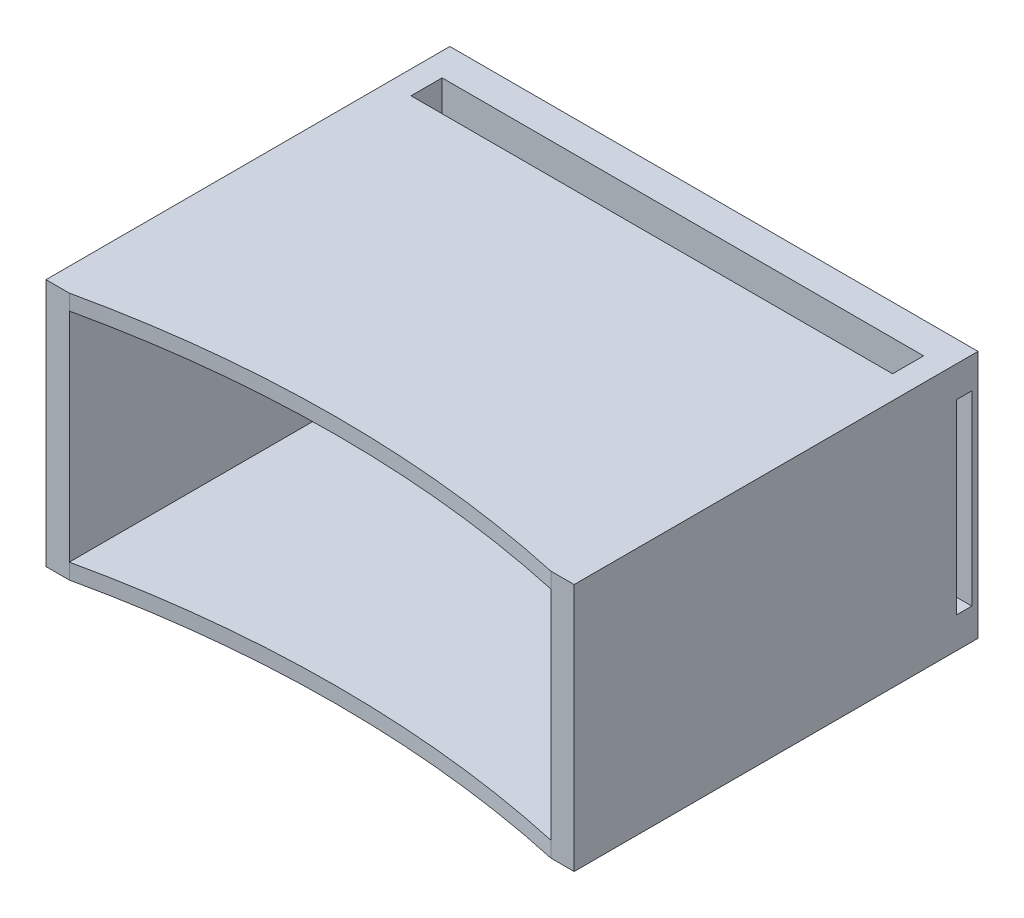
ISO-10303-21;
HEADER;
FILE_DESCRIPTION(('STEP AP214'),'2;1');
FILE_NAME('part.step','',(''),(''),'','','');
FILE_SCHEMA(('AUTOMOTIVE_DESIGN { 1 0 10303 214 1 1 1 1 }'));
ENDSEC;
DATA;
#1=APPLICATION_CONTEXT('core data for automotive mechanical design processes');
#2=APPLICATION_PROTOCOL_DEFINITION('international standard','automotive_design',2000,#1);
#3=PRODUCT_CONTEXT('',#1,'mechanical');
#4=PRODUCT('Part','Part','',(#3));
#5=PRODUCT_RELATED_PRODUCT_CATEGORY('part','',(#4));
#6=PRODUCT_DEFINITION_FORMATION('','',#4);
#7=PRODUCT_DEFINITION_CONTEXT('part definition',#1,'design');
#8=PRODUCT_DEFINITION('design','',#6,#7);
#9=PRODUCT_DEFINITION_SHAPE('','',#8);
#10=(LENGTH_UNIT() NAMED_UNIT(*) SI_UNIT(.MILLI.,.METRE.));
#11=(NAMED_UNIT(*) PLANE_ANGLE_UNIT() SI_UNIT($,.RADIAN.));
#12=(NAMED_UNIT(*) SI_UNIT($,.STERADIAN.) SOLID_ANGLE_UNIT());
#13=UNCERTAINTY_MEASURE_WITH_UNIT(LENGTH_MEASURE(1.E-05),#10,'distance_accuracy_value','');
#14=(GEOMETRIC_REPRESENTATION_CONTEXT(3) GLOBAL_UNCERTAINTY_ASSIGNED_CONTEXT((#13)) GLOBAL_UNIT_ASSIGNED_CONTEXT((#10,
#11,#12)) REPRESENTATION_CONTEXT('',''));
#15=CARTESIAN_POINT('',(0.,0.,0.));
#16=DIRECTION('',(0.,0.,1.));
#17=DIRECTION('',(1.,0.,0.));
#18=AXIS2_PLACEMENT_3D('',#15,#16,#17);
#19=CARTESIAN_POINT('',(0.,0.,85.));
#20=DIRECTION('',(0.,0.,-1.));
#21=DIRECTION('',(-1.,0.,0.));
#22=AXIS2_PLACEMENT_3D('',#19,#20,#21);
#23=PLANE('',#22);
#24=DIRECTION('',(1.,0.,0.));
#25=VECTOR('',#24,1.);
#26=CARTESIAN_POINT('',(-85.,0.,85.));
#27=LINE('',#26,#25);
#28=CARTESIAN_POINT('',(-85.,0.,85.));
#29=VERTEX_POINT('',#28);
#30=CARTESIAN_POINT('',(-77.5,0.,85.));
#31=VERTEX_POINT('',#30);
#32=EDGE_CURVE('E303',#29,#31,#27,.T.);
#33=ORIENTED_EDGE('',*,*,#32,.T.);
#34=DIRECTION('',(0.,1.,0.));
#35=VECTOR('',#34,1.);
#36=CARTESIAN_POINT('',(-77.5,0.,85.));
#37=LINE('',#36,#35);
#38=CARTESIAN_POINT('',(-77.5,5.,85.));
#39=VERTEX_POINT('',#38);
#40=EDGE_CURVE('E273',#31,#39,#37,.T.);
#41=ORIENTED_EDGE('',*,*,#40,.T.);
#42=DIRECTION('',(0.,-1.,0.));
#43=VECTOR('',#42,1.);
#44=CARTESIAN_POINT('',(-77.5,75.,85.));
#45=LINE('',#44,#43);
#46=CARTESIAN_POINT('',(-77.5,75.,85.));
#47=VERTEX_POINT('',#46);
#48=EDGE_CURVE('E290',#47,#39,#45,.T.);
#49=ORIENTED_EDGE('',*,*,#48,.F.);
#50=DIRECTION('',(0.,1.,0.));
#51=VECTOR('',#50,1.);
#52=CARTESIAN_POINT('',(-77.4999999999998,0.,85.));
#53=LINE('',#52,#51);
#54=CARTESIAN_POINT('',(-77.5,80.,85.));
#55=VERTEX_POINT('',#54);
#56=EDGE_CURVE('E11',#47,#55,#53,.T.);
#57=ORIENTED_EDGE('',*,*,#56,.T.);
#58=DIRECTION('',(-1.,0.,0.));
#59=VECTOR('',#58,1.);
#60=CARTESIAN_POINT('',(-85.,80.,85.));
#61=LINE('',#60,#59);
#62=CARTESIAN_POINT('',(-85.,80.,85.));
#63=VERTEX_POINT('',#62);
#64=EDGE_CURVE('E311',#55,#63,#61,.T.);
#65=ORIENTED_EDGE('',*,*,#64,.T.);
#66=DIRECTION('',(0.,-1.,0.));
#67=VECTOR('',#66,1.);
#68=CARTESIAN_POINT('',(-85.,0.,85.));
#69=LINE('',#68,#67);
#70=EDGE_CURVE('E298',#63,#29,#69,.T.);
#71=ORIENTED_EDGE('',*,*,#70,.T.);
#72=EDGE_LOOP('',(#33,#41,#49,#57,#65,#71));
#73=FACE_BOUND('',#72,.T.);
#74=ADVANCED_FACE('F41',(#73),#23,.F.);
#75=CARTESIAN_POINT('',(77.5,5.00000000000002,-35.));
#76=DIRECTION('',(0.,-1.,0.));
#77=DIRECTION('',(1.,0.,0.));
#78=AXIS2_PLACEMENT_3D('',#75,#76,#77);
#79=PLANE('',#78);
#80=DIRECTION('',(-1.,0.,0.));
#81=VECTOR('',#80,1.);
#82=CARTESIAN_POINT('',(0.,5.00000000000002,-23.));
#83=LINE('',#82,#81);
#84=CARTESIAN_POINT('',(76.,5.00000000000002,-23.));
#85=VERTEX_POINT('',#84);
#86=CARTESIAN_POINT('',(-76.,5.,-23.));
#87=VERTEX_POINT('',#86);
#88=EDGE_CURVE('E337',#85,#87,#83,.T.);
#89=ORIENTED_EDGE('',*,*,#88,.F.);
#90=DIRECTION('',(0.,0.,-1.));
#91=VECTOR('',#90,1.);
#92=CARTESIAN_POINT('',(76.,5.00000000000002,-20.));
#93=LINE('',#92,#91);
#94=CARTESIAN_POINT('',(76.,5.00000000000002,-35.));
#95=VERTEX_POINT('',#94);
#96=EDGE_CURVE('E413',#85,#95,#93,.T.);
#97=ORIENTED_EDGE('',*,*,#96,.T.);
#98=DIRECTION('',(1.,0.,0.));
#99=VECTOR('',#98,1.);
#100=CARTESIAN_POINT('',(77.5,5.00000000000002,-35.));
#101=LINE('',#100,#99);
#102=CARTESIAN_POINT('',(-76.,5.,-35.));
#103=VERTEX_POINT('',#102);
#104=EDGE_CURVE('E459',#103,#95,#101,.T.);
#105=ORIENTED_EDGE('',*,*,#104,.F.);
#106=DIRECTION('',(0.,0.,-1.));
#107=VECTOR('',#106,1.);
#108=CARTESIAN_POINT('',(-76.,5.,-20.));
#109=LINE('',#108,#107);
#110=EDGE_CURVE('E360',#87,#103,#109,.T.);
#111=ORIENTED_EDGE('',*,*,#110,.F.);
#112=EDGE_LOOP('',(#89,#97,#105,#111));
#113=FACE_BOUND('',#112,.T.);
#114=ADVANCED_FACE('F552',(#113),#79,.F.);
#115=CARTESIAN_POINT('',(76.,0.,-20.));
#116=DIRECTION('',(-1.,0.,0.));
#117=DIRECTION('',(0.,0.,1.));
#118=AXIS2_PLACEMENT_3D('',#115,#116,#117);
#119=PLANE('',#118);
#120=ORIENTED_EDGE('',*,*,#96,.F.);
#121=DIRECTION('',(0.,-1.,0.));
#122=VECTOR('',#121,1.);
#123=CARTESIAN_POINT('',(76.,10.,-23.));
#124=LINE('',#123,#122);
#125=CARTESIAN_POINT('',(76.,10.,-23.));
#126=VERTEX_POINT('',#125);
#127=EDGE_CURVE('E357',#126,#85,#124,.T.);
#128=ORIENTED_EDGE('',*,*,#127,.F.);
#129=DIRECTION('',(0.,0.,1.));
#130=VECTOR('',#129,1.);
#131=CARTESIAN_POINT('',(76.,10.,0.));
#132=LINE('',#131,#130);
#133=CARTESIAN_POINT('',(76.,10.,-20.));
#134=VERTEX_POINT('',#133);
#135=EDGE_CURVE('E317',#126,#134,#132,.T.);
#136=ORIENTED_EDGE('',*,*,#135,.T.);
#137=DIRECTION('',(0.,1.,0.));
#138=VECTOR('',#137,1.);
#139=CARTESIAN_POINT('',(76.,0.,-20.));
#140=LINE('',#139,#138);
#141=CARTESIAN_POINT('',(76.,40.,-20.));
#142=VERTEX_POINT('',#141);
#143=EDGE_CURVE('E405',#134,#142,#140,.T.);
#144=ORIENTED_EDGE('',*,*,#143,.T.);
#145=DIRECTION('',(0.,0.,-1.));
#146=VECTOR('',#145,1.);
#147=CARTESIAN_POINT('',(76.,40.,-20.));
#148=LINE('',#147,#146);
#149=CARTESIAN_POINT('',(76.,40.,-35.));
#150=VERTEX_POINT('',#149);
#151=EDGE_CURVE('E421',#142,#150,#148,.T.);
#152=ORIENTED_EDGE('',*,*,#151,.T.);
#153=DIRECTION('',(0.,1.,0.));
#154=VECTOR('',#153,1.);
#155=CARTESIAN_POINT('',(76.,0.,-35.));
#156=LINE('',#155,#154);
#157=EDGE_CURVE('E401',#95,#150,#156,.T.);
#158=ORIENTED_EDGE('',*,*,#157,.F.);
#159=EDGE_LOOP('',(#120,#128,#136,#144,#152,#158));
#160=FACE_BOUND('',#159,.T.);
#161=ADVANCED_FACE('F544',(#160),#119,.T.);
#162=CARTESIAN_POINT('',(-76.,5.,-20.));
#163=DIRECTION('',(-1.,0.,0.));
#164=DIRECTION('',(0.,0.,1.));
#165=AXIS2_PLACEMENT_3D('',#162,#163,#164);
#166=PLANE('',#165);
#167=DIRECTION('',(0.,-1.,0.));
#168=VECTOR('',#167,1.);
#169=CARTESIAN_POINT('',(-76.,10.,-23.));
#170=LINE('',#169,#168);
#171=CARTESIAN_POINT('',(-76.,10.,-23.));
#172=VERTEX_POINT('',#171);
#173=EDGE_CURVE('E353',#172,#87,#170,.T.);
#174=ORIENTED_EDGE('',*,*,#173,.T.);
#175=ORIENTED_EDGE('',*,*,#110,.T.);
#176=DIRECTION('',(0.,1.,0.));
#177=VECTOR('',#176,1.);
#178=CARTESIAN_POINT('',(-76.,5.,-35.));
#179=LINE('',#178,#177);
#180=CARTESIAN_POINT('',(-76.,40.,-35.));
#181=VERTEX_POINT('',#180);
#182=EDGE_CURVE('E375',#103,#181,#179,.T.);
#183=ORIENTED_EDGE('',*,*,#182,.T.);
#184=DIRECTION('',(0.,0.,-1.));
#185=VECTOR('',#184,1.);
#186=CARTESIAN_POINT('',(-76.,40.,-20.));
#187=LINE('',#186,#185);
#188=CARTESIAN_POINT('',(-76.,40.,-20.));
#189=VERTEX_POINT('',#188);
#190=EDGE_CURVE('E363',#189,#181,#187,.T.);
#191=ORIENTED_EDGE('',*,*,#190,.F.);
#192=DIRECTION('',(0.,1.,0.));
#193=VECTOR('',#192,1.);
#194=CARTESIAN_POINT('',(-76.,5.,-20.));
#195=LINE('',#194,#193);
#196=CARTESIAN_POINT('',(-76.,10.,-20.));
#197=VERTEX_POINT('',#196);
#198=EDGE_CURVE('E388',#197,#189,#195,.T.);
#199=ORIENTED_EDGE('',*,*,#198,.F.);
#200=DIRECTION('',(0.,0.,1.));
#201=VECTOR('',#200,1.);
#202=CARTESIAN_POINT('',(-76.,10.,0.));
#203=LINE('',#202,#201);
#204=EDGE_CURVE('E326',#172,#197,#203,.T.);
#205=ORIENTED_EDGE('',*,*,#204,.F.);
#206=EDGE_LOOP('',(#174,#175,#183,#191,#199,#205));
#207=FACE_BOUND('',#206,.T.);
#208=ADVANCED_FACE('F556',(#207),#166,.F.);
#209=CARTESIAN_POINT('',(0.,0.,-35.));
#210=DIRECTION('',(0.,0.,1.));
#211=DIRECTION('',(1.,0.,0.));
#212=AXIS2_PLACEMENT_3D('',#209,#210,#211);
#213=PLANE('',#212);
#214=DIRECTION('',(1.,0.,0.));
#215=VECTOR('',#214,1.);
#216=CARTESIAN_POINT('',(-77.5,40.,-35.));
#217=LINE('',#216,#215);
#218=CARTESIAN_POINT('',(-77.5,40.,-35.));
#219=VERTEX_POINT('',#218);
#220=EDGE_CURVE('E371',#219,#181,#217,.T.);
#221=ORIENTED_EDGE('',*,*,#220,.T.);
#222=ORIENTED_EDGE('',*,*,#182,.F.);
#223=ORIENTED_EDGE('',*,*,#104,.T.);
#224=ORIENTED_EDGE('',*,*,#157,.T.);
#225=DIRECTION('',(-1.,0.,0.));
#226=VECTOR('',#225,1.);
#227=CARTESIAN_POINT('',(5.55111512312583E-13,40.0000000000011,-35.));
#228=LINE('',#227,#226);
#229=CARTESIAN_POINT('',(77.5,40.,-35.));
#230=VERTEX_POINT('',#229);
#231=EDGE_CURVE('E380',#230,#150,#228,.T.);
#232=ORIENTED_EDGE('',*,*,#231,.F.);
#233=DIRECTION('',(0.,1.,0.));
#234=VECTOR('',#233,1.);
#235=CARTESIAN_POINT('',(77.5,5.00000000000002,-35.));
#236=LINE('',#235,#234);
#237=CARTESIAN_POINT('',(77.5,80.,-35.));
#238=VERTEX_POINT('',#237);
#239=EDGE_CURVE('E463',#230,#238,#236,.T.);
#240=ORIENTED_EDGE('',*,*,#239,.T.);
#241=DIRECTION('',(-1.,0.,0.));
#242=VECTOR('',#241,1.);
#243=CARTESIAN_POINT('',(0.,80.,-35.));
#244=LINE('',#243,#242);
#245=CARTESIAN_POINT('',(-77.5,80.,-35.));
#246=VERTEX_POINT('',#245);
#247=EDGE_CURVE('E429',#238,#246,#244,.T.);
#248=ORIENTED_EDGE('',*,*,#247,.T.);
#249=DIRECTION('',(0.,-1.,0.));
#250=VECTOR('',#249,1.);
#251=CARTESIAN_POINT('',(-77.5,5.,-35.));
#252=LINE('',#251,#250);
#253=EDGE_CURVE('E455',#246,#219,#252,.T.);
#254=ORIENTED_EDGE('',*,*,#253,.T.);
#255=EDGE_LOOP('',(#221,#222,#223,#224,#232,#240,#248,#254));
#256=FACE_BOUND('',#255,.T.);
#257=ADVANCED_FACE('F560',(#256),#213,.T.);
#258=DIRECTION('',(0.,0.,1.));
#259=VECTOR('',#258,1.);
#260=CARTESIAN_POINT('',(-77.5,5.,-35.));
#261=LINE('',#260,#259);
#262=CARTESIAN_POINT('',(-77.5,5.,-20.));
#263=VERTEX_POINT('',#262);
#264=EDGE_CURVE('E466',#263,#39,#261,.T.);
#265=ORIENTED_EDGE('',*,*,#264,.T.);
#266=CARTESIAN_POINT('',(0.,5.00000000000002,436.559027760631));
#267=DIRECTION('',(0.,-1.,0.));
#268=DIRECTION('',(1.,0.,0.));
#269=AXIS2_PLACEMENT_3D('',#266,#267,#268);
#270=CIRCLE('',#269,360.);
#271=CARTESIAN_POINT('',(77.5,5.00000000000002,85.));
#272=VERTEX_POINT('',#271);
#273=EDGE_CURVE('E286',#39,#272,#270,.T.);
#274=ORIENTED_EDGE('',*,*,#273,.T.);
#275=DIRECTION('',(0.,0.,1.));
#276=VECTOR('',#275,1.);
#277=CARTESIAN_POINT('',(77.5,5.00000000000002,-35.));
#278=LINE('',#277,#276);
#279=CARTESIAN_POINT('',(77.5,5.00000000000002,-20.));
#280=VERTEX_POINT('',#279);
#281=EDGE_CURVE('E476',#280,#272,#278,.T.);
#282=ORIENTED_EDGE('',*,*,#281,.F.);
#283=DIRECTION('',(1.,0.,0.));
#284=VECTOR('',#283,1.);
#285=CARTESIAN_POINT('',(0.,5.00000000000002,-20.));
#286=LINE('',#285,#284);
#287=CARTESIAN_POINT('',(76.,5.00000000000002,-20.));
#288=VERTEX_POINT('',#287);
#289=EDGE_CURVE('E409',#288,#280,#286,.T.);
#290=ORIENTED_EDGE('',*,*,#289,.F.);
#291=DIRECTION('',(0.,0.,1.));
#292=VECTOR('',#291,1.);
#293=CARTESIAN_POINT('',(76.,5.00000000000002,0.));
#294=LINE('',#293,#292);
#295=CARTESIAN_POINT('',(76.,5.00000000000002,-19.5));
#296=VERTEX_POINT('',#295);
#297=EDGE_CURVE('E316',#288,#296,#294,.T.);
#298=ORIENTED_EDGE('',*,*,#297,.T.);
#299=DIRECTION('',(1.,0.,0.));
#300=VECTOR('',#299,1.);
#301=CARTESIAN_POINT('',(0.,5.00000000000002,-19.5));
#302=LINE('',#301,#300);
#303=CARTESIAN_POINT('',(-76.,5.,-19.5));
#304=VERTEX_POINT('',#303);
#305=EDGE_CURVE('E343',#304,#296,#302,.T.);
#306=ORIENTED_EDGE('',*,*,#305,.F.);
#307=DIRECTION('',(0.,0.,1.));
#308=VECTOR('',#307,1.);
#309=CARTESIAN_POINT('',(-76.,5.,0.));
#310=LINE('',#309,#308);
#311=CARTESIAN_POINT('',(-76.,5.,-20.));
#312=VERTEX_POINT('',#311);
#313=EDGE_CURVE('E340',#312,#304,#310,.T.);
#314=ORIENTED_EDGE('',*,*,#313,.F.);
#315=DIRECTION('',(1.,0.,0.));
#316=VECTOR('',#315,1.);
#317=CARTESIAN_POINT('',(-77.5,5.,-20.));
#318=LINE('',#317,#316);
#319=EDGE_CURVE('E376',#263,#312,#318,.T.);
#320=ORIENTED_EDGE('',*,*,#319,.F.);
#321=EDGE_LOOP('',(#265,#274,#282,#290,#298,#306,#314,#320));
#322=FACE_BOUND('',#321,.T.);
#323=ADVANCED_FACE('F527',(#322),#79,.F.);
#324=CARTESIAN_POINT('',(77.5,5.00000000000002,-35.));
#325=DIRECTION('',(1.,0.,0.));
#326=DIRECTION('',(0.,0.,-1.));
#327=AXIS2_PLACEMENT_3D('',#324,#325,#326);
#328=PLANE('',#327);
#329=DIRECTION('',(0.,0.,-1.));
#330=VECTOR('',#329,1.);
#331=CARTESIAN_POINT('',(77.5,40.,-20.));
#332=LINE('',#331,#330);
#333=CARTESIAN_POINT('',(77.5,40.,-20.));
#334=VERTEX_POINT('',#333);
#335=EDGE_CURVE('E425',#334,#230,#332,.T.);
#336=ORIENTED_EDGE('',*,*,#335,.F.);
#337=DIRECTION('',(0.,1.,0.));
#338=VECTOR('',#337,1.);
#339=CARTESIAN_POINT('',(77.5,0.,-20.));
#340=LINE('',#339,#338);
#341=EDGE_CURVE('E396',#280,#334,#340,.T.);
#342=ORIENTED_EDGE('',*,*,#341,.F.);
#343=ORIENTED_EDGE('',*,*,#281,.T.);
#344=DIRECTION('',(0.,1.,0.));
#345=VECTOR('',#344,1.);
#346=CARTESIAN_POINT('',(77.5,5.00000000000002,85.));
#347=LINE('',#346,#345);
#348=CARTESIAN_POINT('',(77.5,75.,85.));
#349=VERTEX_POINT('',#348);
#350=EDGE_CURVE('E294',#272,#349,#347,.T.);
#351=ORIENTED_EDGE('',*,*,#350,.T.);
#352=DIRECTION('',(0.,0.,1.));
#353=VECTOR('',#352,1.);
#354=CARTESIAN_POINT('',(77.5,75.,-35.));
#355=LINE('',#354,#353);
#356=CARTESIAN_POINT('',(77.5,75.,-25.));
#357=VERTEX_POINT('',#356);
#358=EDGE_CURVE('E472',#357,#349,#355,.T.);
#359=ORIENTED_EDGE('',*,*,#358,.F.);
#360=DIRECTION('',(0.,1.,0.));
#361=VECTOR('',#360,1.);
#362=CARTESIAN_POINT('',(77.5,5.,-25.));
#363=LINE('',#362,#361);
#364=CARTESIAN_POINT('',(77.5,80.,-25.));
#365=VERTEX_POINT('',#364);
#366=EDGE_CURVE('E446',#357,#365,#363,.T.);
#367=ORIENTED_EDGE('',*,*,#366,.T.);
#368=DIRECTION('',(0.,0.,1.));
#369=VECTOR('',#368,1.);
#370=CARTESIAN_POINT('',(77.5,80.,0.));
#371=LINE('',#370,#369);
#372=EDGE_CURVE('E441',#238,#365,#371,.T.);
#373=ORIENTED_EDGE('',*,*,#372,.F.);
#374=ORIENTED_EDGE('',*,*,#239,.F.);
#375=EDGE_LOOP('',(#336,#342,#343,#351,#359,#367,#373,#374));
#376=FACE_BOUND('',#375,.T.);
#377=ADVANCED_FACE('F523',(#376),#328,.F.);
#378=CARTESIAN_POINT('',(77.5,75.,-35.));
#379=DIRECTION('',(0.,1.,0.));
#380=DIRECTION('',(-1.,0.,0.));
#381=AXIS2_PLACEMENT_3D('',#378,#379,#380);
#382=PLANE('',#381);
#383=ORIENTED_EDGE('',*,*,#358,.T.);
#384=CARTESIAN_POINT('',(0.,75.,436.559027760631));
#385=DIRECTION('',(0.,1.,0.));
#386=DIRECTION('',(-1.,0.,0.));
#387=AXIS2_PLACEMENT_3D('',#384,#385,#386);
#388=CIRCLE('',#387,360.);
#389=EDGE_CURVE('E279',#349,#47,#388,.T.);
#390=ORIENTED_EDGE('',*,*,#389,.T.);
#391=DIRECTION('',(0.,0.,1.));
#392=VECTOR('',#391,1.);
#393=CARTESIAN_POINT('',(-77.5,75.,-35.));
#394=LINE('',#393,#392);
#395=CARTESIAN_POINT('',(-77.5,75.,-25.));
#396=VERTEX_POINT('',#395);
#397=EDGE_CURVE('E467',#396,#47,#394,.T.);
#398=ORIENTED_EDGE('',*,*,#397,.F.);
#399=DIRECTION('',(-1.,0.,0.));
#400=VECTOR('',#399,1.);
#401=CARTESIAN_POINT('',(77.5,75.,-25.));
#402=LINE('',#401,#400);
#403=EDGE_CURVE('E449',#357,#396,#402,.T.);
#404=ORIENTED_EDGE('',*,*,#403,.F.);
#405=EDGE_LOOP('',(#383,#390,#398,#404));
#406=FACE_BOUND('',#405,.T.);
#407=ADVANCED_FACE('F520',(#406),#382,.F.);
#408=CARTESIAN_POINT('',(-85.,80.,45.));
#409=DIRECTION('',(1.,0.,0.));
#410=DIRECTION('',(0.,0.,-1.));
#411=AXIS2_PLACEMENT_3D('',#408,#409,#410);
#412=PLANE('',#411);
#413=DIRECTION('',(0.,0.,1.));
#414=VECTOR('',#413,1.);
#415=CARTESIAN_POINT('',(-85.,70.,-38.));
#416=LINE('',#415,#414);
#417=CARTESIAN_POINT('',(-85.,70.,-43.));
#418=VERTEX_POINT('',#417);
#419=CARTESIAN_POINT('',(-85.,70.,-38.));
#420=VERTEX_POINT('',#419);
#421=EDGE_CURVE('E230',#418,#420,#416,.T.);
#422=ORIENTED_EDGE('',*,*,#421,.T.);
#423=DIRECTION('',(0.,-1.,0.));
#424=VECTOR('',#423,1.);
#425=CARTESIAN_POINT('',(-85.,70.,-38.));
#426=LINE('',#425,#424);
#427=CARTESIAN_POINT('',(-85.,10.,-38.));
#428=VERTEX_POINT('',#427);
#429=EDGE_CURVE('E223',#420,#428,#426,.T.);
#430=ORIENTED_EDGE('',*,*,#429,.T.);
#431=DIRECTION('',(0.,0.,-1.));
#432=VECTOR('',#431,1.);
#433=CARTESIAN_POINT('',(-85.,10.,-38.));
#434=LINE('',#433,#432);
#435=CARTESIAN_POINT('',(-85.,10.,-43.));
#436=VERTEX_POINT('',#435);
#437=EDGE_CURVE('E233',#428,#436,#434,.T.);
#438=ORIENTED_EDGE('',*,*,#437,.T.);
#439=DIRECTION('',(0.,1.,0.));
#440=VECTOR('',#439,1.);
#441=CARTESIAN_POINT('',(-85.,70.,-43.));
#442=LINE('',#441,#440);
#443=EDGE_CURVE('E57',#436,#418,#442,.T.);
#444=ORIENTED_EDGE('',*,*,#443,.T.);
#445=EDGE_LOOP('',(#422,#430,#438,#444));
#446=FACE_BOUND('',#445,.T.);
#447=DIRECTION('',(0.,0.,1.));
#448=VECTOR('',#447,1.);
#449=CARTESIAN_POINT('',(-85.,0.,45.));
#450=LINE('',#449,#448);
#451=CARTESIAN_POINT('',(-85.,0.,-45.));
#452=VERTEX_POINT('',#451);
#453=EDGE_CURVE('E471',#452,#29,#450,.T.);
#454=ORIENTED_EDGE('',*,*,#453,.T.);
#455=ORIENTED_EDGE('',*,*,#70,.F.);
#456=DIRECTION('',(0.,0.,1.));
#457=VECTOR('',#456,1.);
#458=CARTESIAN_POINT('',(-85.,80.,45.));
#459=LINE('',#458,#457);
#460=CARTESIAN_POINT('',(-85.,80.,-45.));
#461=VERTEX_POINT('',#460);
#462=EDGE_CURVE('E483',#461,#63,#459,.T.);
#463=ORIENTED_EDGE('',*,*,#462,.F.);
#464=DIRECTION('',(0.,-1.,0.));
#465=VECTOR('',#464,1.);
#466=CARTESIAN_POINT('',(-85.,80.,-45.));
#467=LINE('',#466,#465);
#468=EDGE_CURVE('E494',#461,#452,#467,.T.);
#469=ORIENTED_EDGE('',*,*,#468,.T.);
#470=EDGE_LOOP('',(#454,#455,#463,#469));
#471=FACE_BOUND('',#470,.T.);
#472=ADVANCED_FACE('F43',(#446,#471),#412,.F.);
#473=CARTESIAN_POINT('',(85.,80.,45.));
#474=DIRECTION('',(-1.,0.,0.));
#475=DIRECTION('',(0.,0.,1.));
#476=AXIS2_PLACEMENT_3D('',#473,#474,#475);
#477=PLANE('',#476);
#478=DIRECTION('',(0.,0.,-1.));
#479=VECTOR('',#478,1.);
#480=CARTESIAN_POINT('',(85.,10.,-38.));
#481=LINE('',#480,#479);
#482=CARTESIAN_POINT('',(85.,10.,-38.));
#483=VERTEX_POINT('',#482);
#484=CARTESIAN_POINT('',(85.,10.,-43.));
#485=VERTEX_POINT('',#484);
#486=EDGE_CURVE('E254',#483,#485,#481,.T.);
#487=ORIENTED_EDGE('',*,*,#486,.F.);
#488=DIRECTION('',(0.,-1.,0.));
#489=VECTOR('',#488,1.);
#490=CARTESIAN_POINT('',(85.,70.,-38.));
#491=LINE('',#490,#489);
#492=CARTESIAN_POINT('',(85.,70.,-38.));
#493=VERTEX_POINT('',#492);
#494=EDGE_CURVE('E65',#493,#483,#491,.T.);
#495=ORIENTED_EDGE('',*,*,#494,.F.);
#496=DIRECTION('',(0.,0.,1.));
#497=VECTOR('',#496,1.);
#498=CARTESIAN_POINT('',(85.,70.,-38.));
#499=LINE('',#498,#497);
#500=CARTESIAN_POINT('',(85.,70.,-43.));
#501=VERTEX_POINT('',#500);
#502=EDGE_CURVE('E241',#501,#493,#499,.T.);
#503=ORIENTED_EDGE('',*,*,#502,.F.);
#504=DIRECTION('',(0.,1.,0.));
#505=VECTOR('',#504,1.);
#506=CARTESIAN_POINT('',(85.,70.,-43.));
#507=LINE('',#506,#505);
#508=EDGE_CURVE('E245',#485,#501,#507,.T.);
#509=ORIENTED_EDGE('',*,*,#508,.F.);
#510=EDGE_LOOP('',(#487,#495,#503,#509));
#511=FACE_BOUND('',#510,.T.);
#512=DIRECTION('',(0.,0.,-1.));
#513=VECTOR('',#512,1.);
#514=CARTESIAN_POINT('',(85.,0.,45.));
#515=LINE('',#514,#513);
#516=CARTESIAN_POINT('',(85.,0.,85.));
#517=VERTEX_POINT('',#516);
#518=CARTESIAN_POINT('',(85.,0.,-45.));
#519=VERTEX_POINT('',#518);
#520=EDGE_CURVE('E497',#517,#519,#515,.T.);
#521=ORIENTED_EDGE('',*,*,#520,.T.);
#522=DIRECTION('',(0.,-1.,0.));
#523=VECTOR('',#522,1.);
#524=CARTESIAN_POINT('',(85.,80.,-45.));
#525=LINE('',#524,#523);
#526=CARTESIAN_POINT('',(85.,80.,-45.));
#527=VERTEX_POINT('',#526);
#528=EDGE_CURVE('E505',#527,#519,#525,.T.);
#529=ORIENTED_EDGE('',*,*,#528,.F.);
#530=DIRECTION('',(0.,0.,-1.));
#531=VECTOR('',#530,1.);
#532=CARTESIAN_POINT('',(85.,80.,45.));
#533=LINE('',#532,#531);
#534=CARTESIAN_POINT('',(85.,80.,85.));
#535=VERTEX_POINT('',#534);
#536=EDGE_CURVE('E487',#535,#527,#533,.T.);
#537=ORIENTED_EDGE('',*,*,#536,.F.);
#538=DIRECTION('',(0.,1.,0.));
#539=VECTOR('',#538,1.);
#540=CARTESIAN_POINT('',(85.,0.,85.));
#541=LINE('',#540,#539);
#542=EDGE_CURVE('E307',#517,#535,#541,.T.);
#543=ORIENTED_EDGE('',*,*,#542,.F.);
#544=EDGE_LOOP('',(#521,#529,#537,#543));
#545=FACE_BOUND('',#544,.T.);
#546=ADVANCED_FACE('F620',(#511,#545),#477,.F.);
#547=CARTESIAN_POINT('',(85.,80.,-45.));
#548=DIRECTION('',(0.,0.,1.));
#549=DIRECTION('',(1.,0.,0.));
#550=AXIS2_PLACEMENT_3D('',#547,#548,#549);
#551=PLANE('',#550);
#552=DIRECTION('',(-1.,0.,0.));
#553=VECTOR('',#552,1.);
#554=CARTESIAN_POINT('',(85.,0.,-45.));
#555=LINE('',#554,#553);
#556=EDGE_CURVE('E488',#519,#452,#555,.T.);
#557=ORIENTED_EDGE('',*,*,#556,.T.);
#558=ORIENTED_EDGE('',*,*,#468,.F.);
#559=DIRECTION('',(-1.,0.,0.));
#560=VECTOR('',#559,1.);
#561=CARTESIAN_POINT('',(85.,80.,-45.));
#562=LINE('',#561,#560);
#563=EDGE_CURVE('E491',#527,#461,#562,.T.);
#564=ORIENTED_EDGE('',*,*,#563,.F.);
#565=ORIENTED_EDGE('',*,*,#528,.T.);
#566=EDGE_LOOP('',(#557,#558,#564,#565));
#567=FACE_BOUND('',#566,.T.);
#568=ADVANCED_FACE('F623',(#567),#551,.F.);
#569=CARTESIAN_POINT('',(0.,80.,0.));
#570=DIRECTION('',(0.,1.,0.));
#571=DIRECTION('',(0.,0.,1.));
#572=AXIS2_PLACEMENT_3D('',#569,#570,#571);
#573=PLANE('',#572);
#574=CARTESIAN_POINT('',(0.,80.,436.559027760631));
#575=DIRECTION('',(0.,1.,0.));
#576=DIRECTION('',(0.,0.,-1.));
#577=AXIS2_PLACEMENT_3D('',#574,#575,#576);
#578=CIRCLE('',#577,360.);
#579=CARTESIAN_POINT('',(77.5,80.,85.));
#580=VERTEX_POINT('',#579);
#581=EDGE_CURVE('E263',#580,#55,#578,.T.);
#582=ORIENTED_EDGE('',*,*,#581,.F.);
#583=EDGE_CURVE('E312',#535,#580,#61,.T.);
#584=ORIENTED_EDGE('',*,*,#583,.F.);
#585=ORIENTED_EDGE('',*,*,#536,.T.);
#586=ORIENTED_EDGE('',*,*,#563,.T.);
#587=ORIENTED_EDGE('',*,*,#462,.T.);
#588=ORIENTED_EDGE('',*,*,#64,.F.);
#589=EDGE_LOOP('',(#582,#584,#585,#586,#587,#588));
#590=FACE_BOUND('',#589,.T.);
#591=ORIENTED_EDGE('',*,*,#247,.F.);
#592=ORIENTED_EDGE('',*,*,#372,.T.);
#593=DIRECTION('',(-1.,0.,0.));
#594=VECTOR('',#593,1.);
#595=CARTESIAN_POINT('',(0.,80.,-25.));
#596=LINE('',#595,#594);
#597=CARTESIAN_POINT('',(-77.5,80.,-25.));
#598=VERTEX_POINT('',#597);
#599=EDGE_CURVE('E437',#365,#598,#596,.T.);
#600=ORIENTED_EDGE('',*,*,#599,.T.);
#601=DIRECTION('',(0.,0.,1.));
#602=VECTOR('',#601,1.);
#603=CARTESIAN_POINT('',(-77.5,80.,0.));
#604=LINE('',#603,#602);
#605=EDGE_CURVE('E433',#246,#598,#604,.T.);
#606=ORIENTED_EDGE('',*,*,#605,.F.);
#607=EDGE_LOOP('',(#591,#592,#600,#606));
#608=FACE_BOUND('',#607,.T.);
#609=ADVANCED_FACE('F640',(#590,#608),#573,.T.);
#610=CARTESIAN_POINT('',(0.,0.,0.));
#611=DIRECTION('',(0.,1.,0.));
#612=DIRECTION('',(0.,0.,1.));
#613=AXIS2_PLACEMENT_3D('',#610,#611,#612);
#614=PLANE('',#613);
#615=CARTESIAN_POINT('',(77.5,0.,85.));
#616=VERTEX_POINT('',#615);
#617=EDGE_CURVE('E302',#616,#517,#27,.T.);
#618=ORIENTED_EDGE('',*,*,#617,.F.);
#619=CARTESIAN_POINT('',(0.,0.,436.559027760631));
#620=DIRECTION('',(0.,1.,0.));
#621=DIRECTION('',(0.,0.,-1.));
#622=AXIS2_PLACEMENT_3D('',#619,#620,#621);
#623=CIRCLE('',#622,360.);
#624=EDGE_CURVE('E269',#616,#31,#623,.T.);
#625=ORIENTED_EDGE('',*,*,#624,.T.);
#626=ORIENTED_EDGE('',*,*,#32,.F.);
#627=ORIENTED_EDGE('',*,*,#453,.F.);
#628=ORIENTED_EDGE('',*,*,#556,.F.);
#629=ORIENTED_EDGE('',*,*,#520,.F.);
#630=EDGE_LOOP('',(#618,#625,#626,#627,#628,#629));
#631=FACE_BOUND('',#630,.T.);
#632=ADVANCED_FACE('F634',(#631),#614,.F.);
#633=CARTESIAN_POINT('',(-77.5,5.,-35.));
#634=DIRECTION('',(-1.,0.,0.));
#635=DIRECTION('',(0.,0.,1.));
#636=AXIS2_PLACEMENT_3D('',#633,#634,#635);
#637=PLANE('',#636);
#638=DIRECTION('',(0.,1.,0.));
#639=VECTOR('',#638,1.);
#640=CARTESIAN_POINT('',(-77.5,5.,-20.));
#641=LINE('',#640,#639);
#642=CARTESIAN_POINT('',(-77.5,40.,-20.));
#643=VERTEX_POINT('',#642);
#644=EDGE_CURVE('E370',#263,#643,#641,.T.);
#645=ORIENTED_EDGE('',*,*,#644,.T.);
#646=DIRECTION('',(0.,0.,-1.));
#647=VECTOR('',#646,1.);
#648=CARTESIAN_POINT('',(-77.5,40.,-20.));
#649=LINE('',#648,#647);
#650=EDGE_CURVE('E366',#643,#219,#649,.T.);
#651=ORIENTED_EDGE('',*,*,#650,.T.);
#652=ORIENTED_EDGE('',*,*,#253,.F.);
#653=ORIENTED_EDGE('',*,*,#605,.T.);
#654=DIRECTION('',(0.,1.,0.));
#655=VECTOR('',#654,1.);
#656=CARTESIAN_POINT('',(-77.5,5.,-25.));
#657=LINE('',#656,#655);
#658=EDGE_CURVE('E445',#396,#598,#657,.T.);
#659=ORIENTED_EDGE('',*,*,#658,.F.);
#660=ORIENTED_EDGE('',*,*,#397,.T.);
#661=ORIENTED_EDGE('',*,*,#48,.T.);
#662=ORIENTED_EDGE('',*,*,#264,.F.);
#663=EDGE_LOOP('',(#645,#651,#652,#653,#659,#660,#661,#662));
#664=FACE_BOUND('',#663,.T.);
#665=ADVANCED_FACE('F565',(#664),#637,.F.);
#666=CARTESIAN_POINT('',(0.,5.,-25.));
#667=DIRECTION('',(0.,0.,-1.));
#668=DIRECTION('',(-1.,0.,0.));
#669=AXIS2_PLACEMENT_3D('',#666,#667,#668);
#670=PLANE('',#669);
#671=ORIENTED_EDGE('',*,*,#403,.T.);
#672=ORIENTED_EDGE('',*,*,#658,.T.);
#673=ORIENTED_EDGE('',*,*,#599,.F.);
#674=ORIENTED_EDGE('',*,*,#366,.F.);
#675=EDGE_LOOP('',(#671,#672,#673,#674));
#676=FACE_BOUND('',#675,.T.);
#677=ADVANCED_FACE('F652',(#676),#670,.T.);
#678=CARTESIAN_POINT('',(5.55111512312583E-13,40.0000000000011,-20.));
#679=DIRECTION('',(0.,-1.,0.));
#680=DIRECTION('',(1.,0.,0.));
#681=AXIS2_PLACEMENT_3D('',#678,#679,#680);
#682=PLANE('',#681);
#683=ORIENTED_EDGE('',*,*,#231,.T.);
#684=ORIENTED_EDGE('',*,*,#151,.F.);
#685=DIRECTION('',(-1.,0.,0.));
#686=VECTOR('',#685,1.);
#687=CARTESIAN_POINT('',(5.55111512312583E-13,40.0000000000011,-20.));
#688=LINE('',#687,#686);
#689=EDGE_CURVE('E400',#334,#142,#688,.T.);
#690=ORIENTED_EDGE('',*,*,#689,.F.);
#691=ORIENTED_EDGE('',*,*,#335,.T.);
#692=EDGE_LOOP('',(#683,#684,#690,#691));
#693=FACE_BOUND('',#692,.T.);
#694=ADVANCED_FACE('F658',(#693),#682,.F.);
#695=CARTESIAN_POINT('',(0.,0.,-20.));
#696=DIRECTION('',(0.,0.,1.));
#697=DIRECTION('',(1.,0.,0.));
#698=AXIS2_PLACEMENT_3D('',#695,#696,#697);
#699=PLANE('',#698);
#700=ORIENTED_EDGE('',*,*,#341,.T.);
#701=ORIENTED_EDGE('',*,*,#689,.T.);
#702=ORIENTED_EDGE('',*,*,#143,.F.);
#703=EDGE_CURVE('E406',#288,#134,#140,.T.);
#704=ORIENTED_EDGE('',*,*,#703,.F.);
#705=ORIENTED_EDGE('',*,*,#289,.T.);
#706=EDGE_LOOP('',(#700,#701,#702,#704,#705));
#707=FACE_BOUND('',#706,.T.);
#708=ADVANCED_FACE('F530',(#707),#699,.T.);
#709=CARTESIAN_POINT('',(-77.5,40.,-20.));
#710=DIRECTION('',(0.,1.,0.));
#711=DIRECTION('',(0.,0.,1.));
#712=AXIS2_PLACEMENT_3D('',#709,#710,#711);
#713=PLANE('',#712);
#714=ORIENTED_EDGE('',*,*,#220,.F.);
#715=ORIENTED_EDGE('',*,*,#650,.F.);
#716=DIRECTION('',(1.,0.,0.));
#717=VECTOR('',#716,1.);
#718=CARTESIAN_POINT('',(-77.5,40.,-20.));
#719=LINE('',#718,#717);
#720=EDGE_CURVE('E384',#643,#189,#719,.T.);
#721=ORIENTED_EDGE('',*,*,#720,.T.);
#722=ORIENTED_EDGE('',*,*,#190,.T.);
#723=EDGE_LOOP('',(#714,#715,#721,#722));
#724=FACE_BOUND('',#723,.T.);
#725=ADVANCED_FACE('F562',(#724),#713,.T.);
#726=CARTESIAN_POINT('',(0.,0.,-20.));
#727=DIRECTION('',(0.,0.,1.));
#728=DIRECTION('',(1.,0.,0.));
#729=AXIS2_PLACEMENT_3D('',#726,#727,#728);
#730=PLANE('',#729);
#731=ORIENTED_EDGE('',*,*,#319,.T.);
#732=EDGE_CURVE('E389',#312,#197,#195,.T.);
#733=ORIENTED_EDGE('',*,*,#732,.T.);
#734=ORIENTED_EDGE('',*,*,#198,.T.);
#735=ORIENTED_EDGE('',*,*,#720,.F.);
#736=ORIENTED_EDGE('',*,*,#644,.F.);
#737=EDGE_LOOP('',(#731,#733,#734,#735,#736));
#738=FACE_BOUND('',#737,.T.);
#739=ADVANCED_FACE('F569',(#738),#730,.T.);
#740=CARTESIAN_POINT('',(76.,10.,0.));
#741=DIRECTION('',(1.,0.,0.));
#742=DIRECTION('',(0.,1.,0.));
#743=AXIS2_PLACEMENT_3D('',#740,#741,#742);
#744=PLANE('',#743);
#745=ORIENTED_EDGE('',*,*,#297,.F.);
#746=ORIENTED_EDGE('',*,*,#703,.T.);
#747=CARTESIAN_POINT('',(76.,10.,-19.5));
#748=VERTEX_POINT('',#747);
#749=EDGE_CURVE('E322',#134,#748,#132,.T.);
#750=ORIENTED_EDGE('',*,*,#749,.T.);
#751=DIRECTION('',(0.,-1.,0.));
#752=VECTOR('',#751,1.);
#753=CARTESIAN_POINT('',(76.,10.,-19.5));
#754=LINE('',#753,#752);
#755=EDGE_CURVE('E333',#748,#296,#754,.T.);
#756=ORIENTED_EDGE('',*,*,#755,.T.);
#757=EDGE_LOOP('',(#745,#746,#750,#756));
#758=FACE_BOUND('',#757,.T.);
#759=ADVANCED_FACE('F534',(#758),#744,.T.);
#760=CARTESIAN_POINT('',(0.,10.,-23.));
#761=DIRECTION('',(0.,0.,1.));
#762=DIRECTION('',(1.,0.,0.));
#763=AXIS2_PLACEMENT_3D('',#760,#761,#762);
#764=PLANE('',#763);
#765=ORIENTED_EDGE('',*,*,#88,.T.);
#766=ORIENTED_EDGE('',*,*,#173,.F.);
#767=DIRECTION('',(-1.,0.,0.));
#768=VECTOR('',#767,1.);
#769=CARTESIAN_POINT('',(0.,10.,-23.));
#770=LINE('',#769,#768);
#771=EDGE_CURVE('E321',#126,#172,#770,.T.);
#772=ORIENTED_EDGE('',*,*,#771,.F.);
#773=ORIENTED_EDGE('',*,*,#127,.T.);
#774=EDGE_LOOP('',(#765,#766,#772,#773));
#775=FACE_BOUND('',#774,.T.);
#776=ADVANCED_FACE('F548',(#775),#764,.F.);
#777=CARTESIAN_POINT('',(-76.,10.,0.));
#778=DIRECTION('',(1.,0.,0.));
#779=DIRECTION('',(0.,1.,0.));
#780=AXIS2_PLACEMENT_3D('',#777,#778,#779);
#781=PLANE('',#780);
#782=ORIENTED_EDGE('',*,*,#732,.F.);
#783=ORIENTED_EDGE('',*,*,#313,.T.);
#784=DIRECTION('',(0.,-1.,0.));
#785=VECTOR('',#784,1.);
#786=CARTESIAN_POINT('',(-76.,10.,-19.5));
#787=LINE('',#786,#785);
#788=CARTESIAN_POINT('',(-76.,10.,-19.5));
#789=VERTEX_POINT('',#788);
#790=EDGE_CURVE('E349',#789,#304,#787,.T.);
#791=ORIENTED_EDGE('',*,*,#790,.F.);
#792=EDGE_CURVE('E325',#197,#789,#203,.T.);
#793=ORIENTED_EDGE('',*,*,#792,.F.);
#794=EDGE_LOOP('',(#782,#783,#791,#793));
#795=FACE_BOUND('',#794,.T.);
#796=ADVANCED_FACE('F574',(#795),#781,.F.);
#797=CARTESIAN_POINT('',(0.,10.,-19.5));
#798=DIRECTION('',(0.,0.,-1.));
#799=DIRECTION('',(-1.,0.,0.));
#800=AXIS2_PLACEMENT_3D('',#797,#798,#799);
#801=PLANE('',#800);
#802=ORIENTED_EDGE('',*,*,#305,.T.);
#803=ORIENTED_EDGE('',*,*,#755,.F.);
#804=DIRECTION('',(1.,0.,0.));
#805=VECTOR('',#804,1.);
#806=CARTESIAN_POINT('',(0.,10.,-19.5));
#807=LINE('',#806,#805);
#808=EDGE_CURVE('E329',#789,#748,#807,.T.);
#809=ORIENTED_EDGE('',*,*,#808,.F.);
#810=ORIENTED_EDGE('',*,*,#790,.T.);
#811=EDGE_LOOP('',(#802,#803,#809,#810));
#812=FACE_BOUND('',#811,.T.);
#813=ADVANCED_FACE('F577',(#812),#801,.F.);
#814=CARTESIAN_POINT('',(0.,10.,0.));
#815=DIRECTION('',(0.,1.,0.));
#816=DIRECTION('',(-1.,0.,0.));
#817=AXIS2_PLACEMENT_3D('',#814,#815,#816);
#818=PLANE('',#817);
#819=ORIENTED_EDGE('',*,*,#135,.F.);
#820=ORIENTED_EDGE('',*,*,#771,.T.);
#821=ORIENTED_EDGE('',*,*,#204,.T.);
#822=ORIENTED_EDGE('',*,*,#792,.T.);
#823=ORIENTED_EDGE('',*,*,#808,.T.);
#824=ORIENTED_EDGE('',*,*,#749,.F.);
#825=EDGE_LOOP('',(#819,#820,#821,#822,#823,#824));
#826=FACE_BOUND('',#825,.T.);
#827=ADVANCED_FACE('F537',(#826),#818,.T.);
#828=ORIENTED_EDGE('',*,*,#583,.T.);
#829=DIRECTION('',(0.,1.,0.));
#830=VECTOR('',#829,1.);
#831=CARTESIAN_POINT('',(77.4999999999999,0.,85.));
#832=LINE('',#831,#830);
#833=EDGE_CURVE('E50',#580,#349,#832,.F.);
#834=ORIENTED_EDGE('',*,*,#833,.T.);
#835=ORIENTED_EDGE('',*,*,#350,.F.);
#836=DIRECTION('',(0.,1.,0.));
#837=VECTOR('',#836,1.);
#838=CARTESIAN_POINT('',(77.5,0.,85.));
#839=LINE('',#838,#837);
#840=EDGE_CURVE('E276',#616,#272,#839,.T.);
#841=ORIENTED_EDGE('',*,*,#840,.F.);
#842=ORIENTED_EDGE('',*,*,#617,.T.);
#843=ORIENTED_EDGE('',*,*,#542,.T.);
#844=EDGE_LOOP('',(#828,#834,#835,#841,#842,#843));
#845=FACE_BOUND('',#844,.T.);
#846=ADVANCED_FACE('F512',(#845),#23,.F.);
#847=CARTESIAN_POINT('',(0.,0.,436.559027760631));
#848=DIRECTION('',(0.,1.,0.));
#849=DIRECTION('',(0.,0.,1.));
#850=AXIS2_PLACEMENT_3D('',#847,#848,#849);
#851=CYLINDRICAL_SURFACE('',#850,360.);
#852=ORIENTED_EDGE('',*,*,#40,.F.);
#853=ORIENTED_EDGE('',*,*,#624,.F.);
#854=ORIENTED_EDGE('',*,*,#840,.T.);
#855=ORIENTED_EDGE('',*,*,#273,.F.);
#856=EDGE_LOOP('',(#852,#853,#854,#855));
#857=FACE_BOUND('',#856,.T.);
#858=ADVANCED_FACE('F595',(#857),#851,.F.);
#859=ORIENTED_EDGE('',*,*,#833,.F.);
#860=ORIENTED_EDGE('',*,*,#581,.T.);
#861=ORIENTED_EDGE('',*,*,#56,.F.);
#862=ORIENTED_EDGE('',*,*,#389,.F.);
#863=EDGE_LOOP('',(#859,#860,#861,#862));
#864=FACE_BOUND('',#863,.T.);
#865=ADVANCED_FACE('F599',(#864),#851,.F.);
#866=CARTESIAN_POINT('',(-85.,70.,-38.));
#867=DIRECTION('',(0.,0.,1.));
#868=DIRECTION('',(1.,0.,0.));
#869=AXIS2_PLACEMENT_3D('',#866,#867,#868);
#870=PLANE('',#869);
#871=ORIENTED_EDGE('',*,*,#494,.T.);
#872=DIRECTION('',(1.,0.,0.));
#873=VECTOR('',#872,1.);
#874=CARTESIAN_POINT('',(-85.,10.,-38.));
#875=LINE('',#874,#873);
#876=EDGE_CURVE('E219',#428,#483,#875,.T.);
#877=ORIENTED_EDGE('',*,*,#876,.F.);
#878=ORIENTED_EDGE('',*,*,#429,.F.);
#879=DIRECTION('',(1.,0.,0.));
#880=VECTOR('',#879,1.);
#881=CARTESIAN_POINT('',(-85.,70.,-38.));
#882=LINE('',#881,#880);
#883=EDGE_CURVE('E260',#420,#493,#882,.T.);
#884=ORIENTED_EDGE('',*,*,#883,.T.);
#885=EDGE_LOOP('',(#871,#877,#878,#884));
#886=FACE_BOUND('',#885,.T.);
#887=ADVANCED_FACE('F221',(#886),#870,.F.);
#888=CARTESIAN_POINT('',(-85.,70.,-38.));
#889=DIRECTION('',(0.,1.,0.));
#890=DIRECTION('',(0.,0.,1.));
#891=AXIS2_PLACEMENT_3D('',#888,#889,#890);
#892=PLANE('',#891);
#893=ORIENTED_EDGE('',*,*,#502,.T.);
#894=ORIENTED_EDGE('',*,*,#883,.F.);
#895=ORIENTED_EDGE('',*,*,#421,.F.);
#896=DIRECTION('',(1.,0.,0.));
#897=VECTOR('',#896,1.);
#898=CARTESIAN_POINT('',(-85.,70.,-43.));
#899=LINE('',#898,#897);
#900=EDGE_CURVE('E264',#418,#501,#899,.T.);
#901=ORIENTED_EDGE('',*,*,#900,.T.);
#902=EDGE_LOOP('',(#893,#894,#895,#901));
#903=FACE_BOUND('',#902,.T.);
#904=ADVANCED_FACE('F607',(#903),#892,.F.);
#905=CARTESIAN_POINT('',(-85.,70.,-43.));
#906=DIRECTION('',(0.,0.,-1.));
#907=DIRECTION('',(-1.,0.,0.));
#908=AXIS2_PLACEMENT_3D('',#905,#906,#907);
#909=PLANE('',#908);
#910=ORIENTED_EDGE('',*,*,#508,.T.);
#911=ORIENTED_EDGE('',*,*,#900,.F.);
#912=ORIENTED_EDGE('',*,*,#443,.F.);
#913=DIRECTION('',(1.,0.,0.));
#914=VECTOR('',#913,1.);
#915=CARTESIAN_POINT('',(-85.,10.,-43.));
#916=LINE('',#915,#914);
#917=EDGE_CURVE('E229',#436,#485,#916,.T.);
#918=ORIENTED_EDGE('',*,*,#917,.T.);
#919=EDGE_LOOP('',(#910,#911,#912,#918));
#920=FACE_BOUND('',#919,.T.);
#921=ADVANCED_FACE('F610',(#920),#909,.F.);
#922=CARTESIAN_POINT('',(-85.,10.,-38.));
#923=DIRECTION('',(0.,-1.,0.));
#924=DIRECTION('',(0.,0.,-1.));
#925=AXIS2_PLACEMENT_3D('',#922,#923,#924);
#926=PLANE('',#925);
#927=ORIENTED_EDGE('',*,*,#486,.T.);
#928=ORIENTED_EDGE('',*,*,#917,.F.);
#929=ORIENTED_EDGE('',*,*,#437,.F.);
#930=ORIENTED_EDGE('',*,*,#876,.T.);
#931=EDGE_LOOP('',(#927,#928,#929,#930));
#932=FACE_BOUND('',#931,.T.);
#933=ADVANCED_FACE('F234',(#932),#926,.F.);
#934=CLOSED_SHELL('',(#74,#114,#161,#208,#257,#323,#377,#407,#472,#546,#568,#609,#632,#665,#677,
#694,#708,#725,#739,#759,#776,#796,#813,#827,#846,#858,#865,#887,#904,#921,#933));
#935=MANIFOLD_SOLID_BREP('B2',#934);
#936=ADVANCED_BREP_SHAPE_REPRESENTATION('',(#18,#935),#14);
#937=SHAPE_DEFINITION_REPRESENTATION(#9,#936);
ENDSEC;
END-ISO-10303-21;
